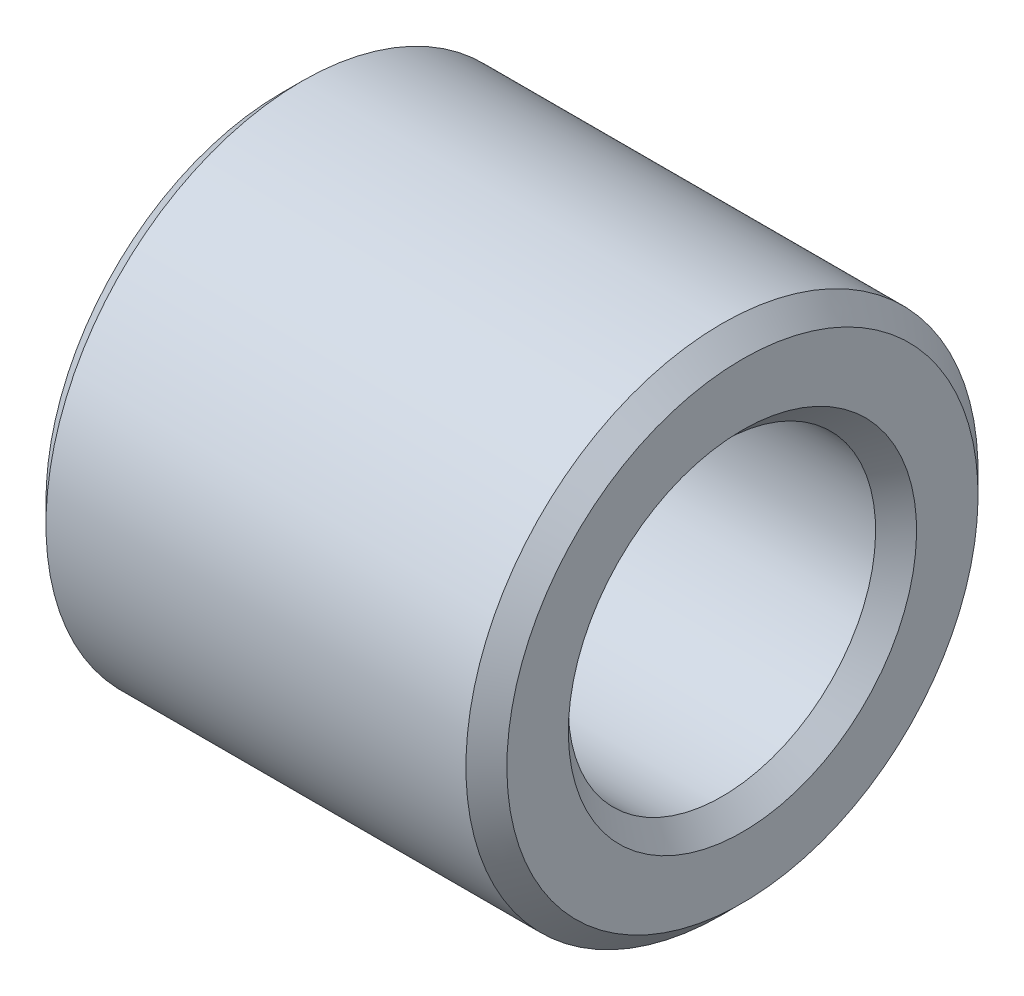
ISO-10303-21;
HEADER;
FILE_DESCRIPTION(('STEP AP214'),'2;1');
FILE_NAME('part.step','',(''),(''),'','','');
FILE_SCHEMA(('AUTOMOTIVE_DESIGN { 1 0 10303 214 1 1 1 1 }'));
ENDSEC;
DATA;
#1=APPLICATION_CONTEXT('core data for automotive mechanical design processes');
#2=APPLICATION_PROTOCOL_DEFINITION('international standard','automotive_design',2000,#1);
#3=PRODUCT_CONTEXT('',#1,'mechanical');
#4=PRODUCT('Part','Part','',(#3));
#5=PRODUCT_RELATED_PRODUCT_CATEGORY('part','',(#4));
#6=PRODUCT_DEFINITION_FORMATION('','',#4);
#7=PRODUCT_DEFINITION_CONTEXT('part definition',#1,'design');
#8=PRODUCT_DEFINITION('design','',#6,#7);
#9=PRODUCT_DEFINITION_SHAPE('','',#8);
#10=(LENGTH_UNIT() NAMED_UNIT(*) SI_UNIT(.MILLI.,.METRE.));
#11=(NAMED_UNIT(*) PLANE_ANGLE_UNIT() SI_UNIT($,.RADIAN.));
#12=(NAMED_UNIT(*) SI_UNIT($,.STERADIAN.) SOLID_ANGLE_UNIT());
#13=UNCERTAINTY_MEASURE_WITH_UNIT(LENGTH_MEASURE(1.E-05),#10,'distance_accuracy_value','');
#14=(GEOMETRIC_REPRESENTATION_CONTEXT(3) GLOBAL_UNCERTAINTY_ASSIGNED_CONTEXT((#13)) GLOBAL_UNIT_ASSIGNED_CONTEXT((#10,
#11,#12)) REPRESENTATION_CONTEXT('',''));
#15=CARTESIAN_POINT('',(0.,0.,0.));
#16=DIRECTION('',(0.,0.,1.));
#17=DIRECTION('',(1.,0.,0.));
#18=AXIS2_PLACEMENT_3D('',#15,#16,#17);
#19=CARTESIAN_POINT('',(0.2,0.,0.));
#20=DIRECTION('',(-1.,0.,0.));
#21=DIRECTION('',(0.,-1.,0.));
#22=AXIS2_PLACEMENT_3D('',#19,#20,#21);
#23=CONICAL_SURFACE('',#22,1.5,0.785398163397448);
#24=CARTESIAN_POINT('',(0.,0.,0.));
#25=DIRECTION('',(1.,0.,0.));
#26=DIRECTION('',(0.,1.,0.));
#27=AXIS2_PLACEMENT_3D('',#24,#25,#26);
#28=CIRCLE('',#27,1.7);
#29=CARTESIAN_POINT('',(0.,1.7,0.));
#30=VERTEX_POINT('',#29);
#31=EDGE_CURVE('E10',#30,#30,#28,.T.);
#32=ORIENTED_EDGE('',*,*,#31,.F.);
#33=EDGE_LOOP('',(#32));
#34=FACE_BOUND('',#33,.T.);
#35=CARTESIAN_POINT('',(0.2,0.,0.));
#36=DIRECTION('',(1.,0.,0.));
#37=DIRECTION('',(0.,1.,0.));
#38=AXIS2_PLACEMENT_3D('',#35,#36,#37);
#39=CIRCLE('',#38,1.5);
#40=CARTESIAN_POINT('',(0.2,1.5,0.));
#41=VERTEX_POINT('',#40);
#42=EDGE_CURVE('E63',#41,#41,#39,.T.);
#43=ORIENTED_EDGE('',*,*,#42,.T.);
#44=EDGE_LOOP('',(#43));
#45=FACE_BOUND('',#44,.T.);
#46=ADVANCED_FACE('F35',(#34,#45),#23,.F.);
#47=CARTESIAN_POINT('',(0.,-1.7,0.));
#48=DIRECTION('',(1.,0.,0.));
#49=DIRECTION('',(0.,1.,0.));
#50=AXIS2_PLACEMENT_3D('',#47,#48,#49);
#51=PLANE('',#50);
#52=CARTESIAN_POINT('',(0.,0.,0.));
#53=DIRECTION('',(1.,0.,0.));
#54=DIRECTION('',(0.,1.,0.));
#55=AXIS2_PLACEMENT_3D('',#52,#53,#54);
#56=CIRCLE('',#55,2.3);
#57=CARTESIAN_POINT('',(0.,2.3,0.));
#58=VERTEX_POINT('',#57);
#59=EDGE_CURVE('E41',#58,#58,#56,.T.);
#60=ORIENTED_EDGE('',*,*,#59,.F.);
#61=EDGE_LOOP('',(#60));
#62=FACE_BOUND('',#61,.T.);
#63=ORIENTED_EDGE('',*,*,#31,.T.);
#64=EDGE_LOOP('',(#63));
#65=FACE_BOUND('',#64,.T.);
#66=ADVANCED_FACE('F100',(#62,#65),#51,.F.);
#67=CARTESIAN_POINT('',(0.,0.,0.));
#68=DIRECTION('',(1.,0.,0.));
#69=DIRECTION('',(0.,1.,0.));
#70=AXIS2_PLACEMENT_3D('',#67,#68,#69);
#71=CONICAL_SURFACE('',#70,2.3,0.785398163397448);
#72=CARTESIAN_POINT('',(0.2,0.,0.));
#73=DIRECTION('',(1.,0.,0.));
#74=DIRECTION('',(0.,1.,0.));
#75=AXIS2_PLACEMENT_3D('',#72,#73,#74);
#76=CIRCLE('',#75,2.5);
#77=CARTESIAN_POINT('',(0.2,2.5,0.));
#78=VERTEX_POINT('',#77);
#79=EDGE_CURVE('E45',#78,#78,#76,.T.);
#80=ORIENTED_EDGE('',*,*,#79,.F.);
#81=EDGE_LOOP('',(#80));
#82=FACE_BOUND('',#81,.T.);
#83=ORIENTED_EDGE('',*,*,#59,.T.);
#84=EDGE_LOOP('',(#83));
#85=FACE_BOUND('',#84,.T.);
#86=ADVANCED_FACE('F95',(#82,#85),#71,.T.);
#87=CARTESIAN_POINT('',(-3.,0.,0.));
#88=DIRECTION('',(1.,0.,0.));
#89=DIRECTION('',(0.,1.,0.));
#90=AXIS2_PLACEMENT_3D('',#87,#88,#89);
#91=CYLINDRICAL_SURFACE('',#90,2.5);
#92=CARTESIAN_POINT('',(4.3,0.,0.));
#93=DIRECTION('',(1.,0.,0.));
#94=DIRECTION('',(0.,1.,0.));
#95=AXIS2_PLACEMENT_3D('',#92,#93,#94);
#96=CIRCLE('',#95,2.5);
#97=CARTESIAN_POINT('',(4.3,2.5,0.));
#98=VERTEX_POINT('',#97);
#99=EDGE_CURVE('E49',#98,#98,#96,.T.);
#100=ORIENTED_EDGE('',*,*,#99,.F.);
#101=EDGE_LOOP('',(#100));
#102=FACE_BOUND('',#101,.T.);
#103=ORIENTED_EDGE('',*,*,#79,.T.);
#104=EDGE_LOOP('',(#103));
#105=FACE_BOUND('',#104,.T.);
#106=ADVANCED_FACE('F89',(#102,#105),#91,.T.);
#107=CARTESIAN_POINT('',(4.3,0.,0.));
#108=DIRECTION('',(-1.,0.,0.));
#109=DIRECTION('',(0.,-1.,0.));
#110=AXIS2_PLACEMENT_3D('',#107,#108,#109);
#111=CONICAL_SURFACE('',#110,2.5,0.785398163397449);
#112=CARTESIAN_POINT('',(4.5,0.,0.));
#113=DIRECTION('',(1.,0.,0.));
#114=DIRECTION('',(0.,1.,0.));
#115=AXIS2_PLACEMENT_3D('',#112,#113,#114);
#116=CIRCLE('',#115,2.3);
#117=CARTESIAN_POINT('',(4.5,2.3,0.));
#118=VERTEX_POINT('',#117);
#119=EDGE_CURVE('E54',#118,#118,#116,.T.);
#120=ORIENTED_EDGE('',*,*,#119,.F.);
#121=EDGE_LOOP('',(#120));
#122=FACE_BOUND('',#121,.T.);
#123=ORIENTED_EDGE('',*,*,#99,.T.);
#124=EDGE_LOOP('',(#123));
#125=FACE_BOUND('',#124,.T.);
#126=ADVANCED_FACE('F83',(#122,#125),#111,.T.);
#127=CARTESIAN_POINT('',(4.5,-2.3,0.));
#128=DIRECTION('',(-1.,0.,0.));
#129=DIRECTION('',(0.,-1.,0.));
#130=AXIS2_PLACEMENT_3D('',#127,#128,#129);
#131=PLANE('',#130);
#132=CARTESIAN_POINT('',(4.5,0.,0.));
#133=DIRECTION('',(1.,0.,0.));
#134=DIRECTION('',(0.,1.,0.));
#135=AXIS2_PLACEMENT_3D('',#132,#133,#134);
#136=CIRCLE('',#135,1.7);
#137=CARTESIAN_POINT('',(4.5,1.7,0.));
#138=VERTEX_POINT('',#137);
#139=EDGE_CURVE('E57',#138,#138,#136,.T.);
#140=ORIENTED_EDGE('',*,*,#139,.F.);
#141=EDGE_LOOP('',(#140));
#142=FACE_BOUND('',#141,.T.);
#143=ORIENTED_EDGE('',*,*,#119,.T.);
#144=EDGE_LOOP('',(#143));
#145=FACE_BOUND('',#144,.T.);
#146=ADVANCED_FACE('F77',(#142,#145),#131,.F.);
#147=CARTESIAN_POINT('',(4.5,0.,0.));
#148=DIRECTION('',(1.,0.,0.));
#149=DIRECTION('',(0.,1.,0.));
#150=AXIS2_PLACEMENT_3D('',#147,#148,#149);
#151=CONICAL_SURFACE('',#150,1.7,0.785398163397449);
#152=CARTESIAN_POINT('',(4.3,0.,0.));
#153=DIRECTION('',(1.,0.,0.));
#154=DIRECTION('',(0.,1.,0.));
#155=AXIS2_PLACEMENT_3D('',#152,#153,#154);
#156=CIRCLE('',#155,1.5);
#157=CARTESIAN_POINT('',(4.3,1.5,0.));
#158=VERTEX_POINT('',#157);
#159=EDGE_CURVE('E60',#158,#158,#156,.T.);
#160=ORIENTED_EDGE('',*,*,#159,.F.);
#161=EDGE_LOOP('',(#160));
#162=FACE_BOUND('',#161,.T.);
#163=ORIENTED_EDGE('',*,*,#139,.T.);
#164=EDGE_LOOP('',(#163));
#165=FACE_BOUND('',#164,.T.);
#166=ADVANCED_FACE('F71',(#162,#165),#151,.F.);
#167=CARTESIAN_POINT('',(-3.,0.,0.));
#168=DIRECTION('',(1.,0.,0.));
#169=DIRECTION('',(0.,1.,0.));
#170=AXIS2_PLACEMENT_3D('',#167,#168,#169);
#171=CYLINDRICAL_SURFACE('',#170,1.5);
#172=ORIENTED_EDGE('',*,*,#42,.F.);
#173=EDGE_LOOP('',(#172));
#174=FACE_BOUND('',#173,.T.);
#175=ORIENTED_EDGE('',*,*,#159,.T.);
#176=EDGE_LOOP('',(#175));
#177=FACE_BOUND('',#176,.T.);
#178=ADVANCED_FACE('F68',(#174,#177),#171,.F.);
#179=CLOSED_SHELL('',(#46,#66,#86,#106,#126,#146,#166,#178));
#180=MANIFOLD_SOLID_BREP('B2',#179);
#181=ADVANCED_BREP_SHAPE_REPRESENTATION('',(#18,#180),#14);
#182=SHAPE_DEFINITION_REPRESENTATION(#9,#181);
ENDSEC;
END-ISO-10303-21;
